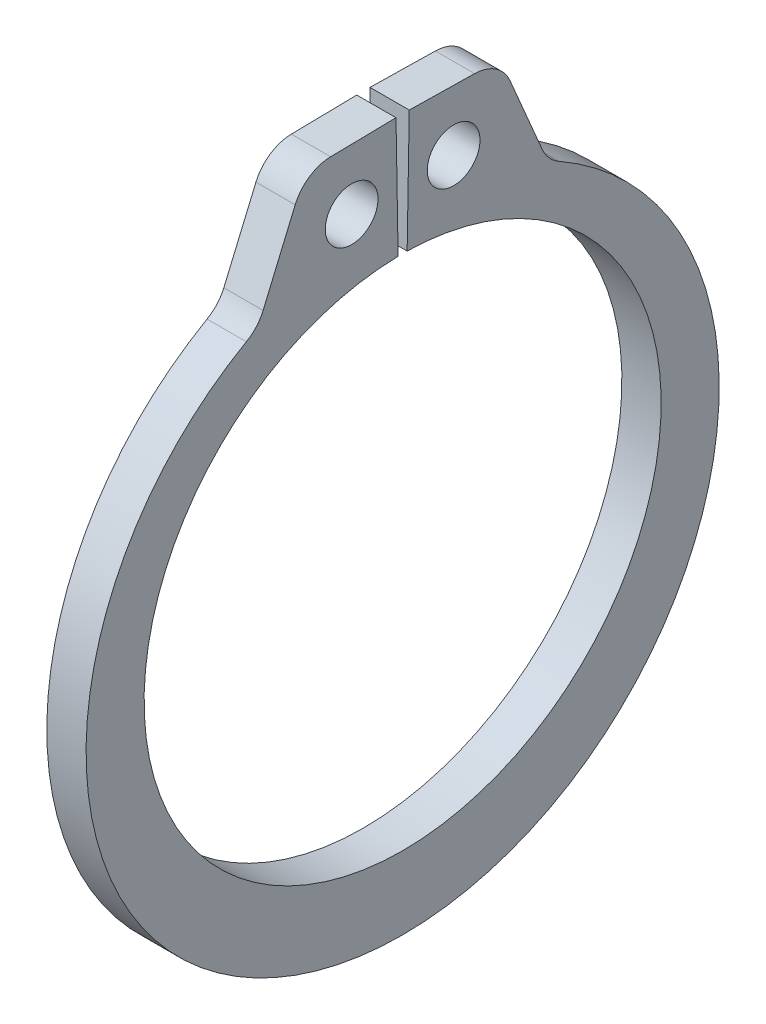
ISO-10303-21;
HEADER;
FILE_DESCRIPTION(('STEP AP214'),'2;1');
FILE_NAME('part.step','',(''),(''),'','','');
FILE_SCHEMA(('AUTOMOTIVE_DESIGN { 1 0 10303 214 1 1 1 1 }'));
ENDSEC;
DATA;
#1=APPLICATION_CONTEXT('core data for automotive mechanical design processes');
#2=APPLICATION_PROTOCOL_DEFINITION('international standard','automotive_design',2000,#1);
#3=PRODUCT_CONTEXT('',#1,'mechanical');
#4=PRODUCT('Part','Part','',(#3));
#5=PRODUCT_RELATED_PRODUCT_CATEGORY('part','',(#4));
#6=PRODUCT_DEFINITION_FORMATION('','',#4);
#7=PRODUCT_DEFINITION_CONTEXT('part definition',#1,'design');
#8=PRODUCT_DEFINITION('design','',#6,#7);
#9=PRODUCT_DEFINITION_SHAPE('','',#8);
#10=(LENGTH_UNIT() NAMED_UNIT(*) SI_UNIT(.MILLI.,.METRE.));
#11=(NAMED_UNIT(*) PLANE_ANGLE_UNIT() SI_UNIT($,.RADIAN.));
#12=(NAMED_UNIT(*) SI_UNIT($,.STERADIAN.) SOLID_ANGLE_UNIT());
#13=UNCERTAINTY_MEASURE_WITH_UNIT(LENGTH_MEASURE(1.E-05),#10,'distance_accuracy_value','');
#14=(GEOMETRIC_REPRESENTATION_CONTEXT(3) GLOBAL_UNCERTAINTY_ASSIGNED_CONTEXT((#13)) GLOBAL_UNIT_ASSIGNED_CONTEXT((#10,
#11,#12)) REPRESENTATION_CONTEXT('',''));
#15=CARTESIAN_POINT('',(0.,0.,0.));
#16=DIRECTION('',(0.,0.,1.));
#17=DIRECTION('',(1.,0.,0.));
#18=AXIS2_PLACEMENT_3D('',#15,#16,#17);
#19=CARTESIAN_POINT('',(0.444500000000014,0.,0.));
#20=DIRECTION('',(1.,0.,0.));
#21=DIRECTION('',(0.,0.,-1.));
#22=AXIS2_PLACEMENT_3D('',#19,#20,#21);
#23=PLANE('',#22);
#24=CARTESIAN_POINT('',(0.444500000000014,7.2072461090066,1.15465964864508));
#25=DIRECTION('',(1.,0.,0.));
#26=DIRECTION('',(0.,0.,-1.));
#27=AXIS2_PLACEMENT_3D('',#24,#25,#26);
#28=CIRCLE('',#27,0.5969);
#29=CARTESIAN_POINT('',(0.444500000000014,7.2072461090066,0.557759648645084));
#30=VERTEX_POINT('',#29);
#31=EDGE_CURVE('E225',#30,#30,#28,.T.);
#32=ORIENTED_EDGE('',*,*,#31,.F.);
#33=EDGE_LOOP('',(#32));
#34=FACE_BOUND('',#33,.T.);
#35=DIRECTION('',(0.,-0.0174524064372841,0.999847695156392));
#36=VECTOR('',#35,1.);
#37=CARTESIAN_POINT('',(0.444500000000014,8.59659049818514,0.150054045307102));
#38=LINE('',#37,#36);
#39=CARTESIAN_POINT('',(0.444500000000014,8.59659049818514,0.150054045307102));
#40=VERTEX_POINT('',#39);
#41=CARTESIAN_POINT('',(0.444500000000014,8.57074959100773,1.63047862600535));
#42=VERTEX_POINT('',#41);
#43=EDGE_CURVE('E137',#40,#42,#38,.T.);
#44=ORIENTED_EDGE('',*,*,#43,.T.);
#45=CARTESIAN_POINT('',(0.444500000000014,7.6818849900137,1.61496343668271));
#46=DIRECTION('',(1.,0.,0.));
#47=DIRECTION('',(0.,0.,-1.));
#48=AXIS2_PLACEMENT_3D('',#45,#46,#47);
#49=CIRCLE('',#48,0.889);
#50=CARTESIAN_POINT('',(0.444500000000016,8.02998759243227,2.4329766261787));
#51=VERTEX_POINT('',#50);
#52=EDGE_CURVE('E178',#42,#51,#49,.T.);
#53=ORIENTED_EDGE('',*,*,#52,.T.);
#54=DIRECTION('',(0.,-0.920149819455568,0.391566481910656));
#55=VECTOR('',#54,1.);
#56=CARTESIAN_POINT('',(0.444500000000016,8.56068391718108,2.20714069332184));
#57=LINE('',#56,#55);
#58=CARTESIAN_POINT('',(0.444500000000016,6.32221463110736,3.15971333386372));
#59=VERTEX_POINT('',#58);
#60=EDGE_CURVE('E217',#51,#59,#57,.T.);
#61=ORIENTED_EDGE('',*,*,#60,.T.);
#62=CARTESIAN_POINT('',(0.444500000000016,6.67031723352593,3.97772652335976));
#63=DIRECTION('',(1.,0.,0.));
#64=DIRECTION('',(0.,0.,-1.));
#65=AXIS2_PLACEMENT_3D('',#62,#63,#64);
#66=CIRCLE('',#65,0.889);
#67=CARTESIAN_POINT('',(0.444500000000014,5.89719335877509,3.53886381784674));
#68=VERTEX_POINT('',#67);
#69=EDGE_CURVE('E185',#59,#68,#66,.F.);
#70=ORIENTED_EDGE('',*,*,#69,.T.);
#71=CARTESIAN_POINT('',(0.444500000000014,-0.33705729114225,0.));
#72=DIRECTION('',(1.,0.,0.));
#73=DIRECTION('',(0.,0.,-1.));
#74=AXIS2_PLACEMENT_3D('',#71,#72,#73);
#75=CIRCLE('',#74,7.16864270885775);
#76=CARTESIAN_POINT('',(0.444500000000014,5.89719335877509,-3.53886381784668));
#77=VERTEX_POINT('',#76);
#78=EDGE_CURVE('E210',#68,#77,#75,.T.);
#79=ORIENTED_EDGE('',*,*,#78,.T.);
#80=CARTESIAN_POINT('',(0.444500000000016,6.67031723352594,-3.97772652335981));
#81=DIRECTION('',(1.,0.,0.));
#82=DIRECTION('',(0.,0.,-1.));
#83=AXIS2_PLACEMENT_3D('',#80,#81,#82);
#84=CIRCLE('',#83,0.889);
#85=CARTESIAN_POINT('',(0.444500000000016,6.32221463110736,-3.15971333386389));
#86=VERTEX_POINT('',#85);
#87=EDGE_CURVE('E11',#77,#86,#84,.F.);
#88=ORIENTED_EDGE('',*,*,#87,.T.);
#89=DIRECTION('',(0.,0.920149819455568,0.391566481910656));
#90=VECTOR('',#89,1.);
#91=CARTESIAN_POINT('',(0.444500000000016,8.56068391718108,-2.2071406933219));
#92=LINE('',#91,#90);
#93=CARTESIAN_POINT('',(0.444500000000016,8.02998759243227,-2.43297662617881));
#94=VERTEX_POINT('',#93);
#95=EDGE_CURVE('E209',#86,#94,#92,.T.);
#96=ORIENTED_EDGE('',*,*,#95,.T.);
#97=CARTESIAN_POINT('',(0.444500000000016,7.6818849900137,-1.61496343668277));
#98=DIRECTION('',(1.,0.,0.));
#99=DIRECTION('',(0.,0.,-1.));
#100=AXIS2_PLACEMENT_3D('',#97,#98,#99);
#101=CIRCLE('',#100,0.889);
#102=CARTESIAN_POINT('',(0.444500000000016,8.57074959100773,-1.63047862600557));
#103=VERTEX_POINT('',#102);
#104=EDGE_CURVE('E53',#94,#103,#101,.T.);
#105=ORIENTED_EDGE('',*,*,#104,.T.);
#106=DIRECTION('',(0.,0.0174524064372841,0.999847695156392));
#107=VECTOR('',#106,1.);
#108=CARTESIAN_POINT('',(0.444500000000014,8.59659049818515,-0.150054045307102));
#109=LINE('',#108,#107);
#110=CARTESIAN_POINT('',(0.444500000000014,8.59659049818515,-0.150054045307102));
#111=VERTEX_POINT('',#110);
#112=EDGE_CURVE('E214',#103,#111,#109,.T.);
#113=ORIENTED_EDGE('',*,*,#112,.T.);
#114=DIRECTION('',(0.,-0.999847695156393,0.0174524064372836));
#115=VECTOR('',#114,1.);
#116=CARTESIAN_POINT('',(0.444500000000014,5.85380830083213,-0.102178603968273));
#117=LINE('',#116,#115);
#118=CARTESIAN_POINT('',(0.444500000000014,5.85380830083213,-0.102178603968273));
#119=VERTEX_POINT('',#118);
#120=EDGE_CURVE('E143',#111,#119,#117,.T.);
#121=ORIENTED_EDGE('',*,*,#120,.T.);
#122=CARTESIAN_POINT('',(0.444500000000014,0.,0.));
#123=DIRECTION('',(-1.,0.,0.));
#124=DIRECTION('',(0.,0.,-1.));
#125=AXIS2_PLACEMENT_3D('',#122,#123,#124);
#126=CIRCLE('',#125,5.8547);
#127=CARTESIAN_POINT('',(0.444500000000014,5.85380830083213,0.102178603968384));
#128=VERTEX_POINT('',#127);
#129=EDGE_CURVE('E138',#119,#128,#126,.T.);
#130=ORIENTED_EDGE('',*,*,#129,.T.);
#131=DIRECTION('',(0.,0.999847695156392,0.0174524064372835));
#132=VECTOR('',#131,1.);
#133=CARTESIAN_POINT('',(0.444500000000014,5.85380830083213,0.102178603968384));
#134=LINE('',#133,#132);
#135=EDGE_CURVE('E129',#128,#40,#134,.T.);
#136=ORIENTED_EDGE('',*,*,#135,.T.);
#137=EDGE_LOOP('',(#44,#53,#61,#70,#79,#88,#96,#105,#113,#121,#130,#136));
#138=FACE_BOUND('',#137,.T.);
#139=CARTESIAN_POINT('',(0.444500000000013,7.20724610900661,-1.15465964864508));
#140=DIRECTION('',(1.,0.,0.));
#141=DIRECTION('',(0.,0.,-1.));
#142=AXIS2_PLACEMENT_3D('',#139,#140,#141);
#143=CIRCLE('',#142,0.5969);
#144=CARTESIAN_POINT('',(0.444500000000013,7.20724610900661,-1.75155964864509));
#145=VERTEX_POINT('',#144);
#146=EDGE_CURVE('E251',#145,#145,#143,.T.);
#147=ORIENTED_EDGE('',*,*,#146,.F.);
#148=EDGE_LOOP('',(#147));
#149=FACE_BOUND('',#148,.T.);
#150=ADVANCED_FACE('F38',(#34,#138,#149),#23,.T.);
#151=CARTESIAN_POINT('',(-0.444500000000014,0.,0.));
#152=DIRECTION('',(1.,0.,0.));
#153=DIRECTION('',(0.,0.,-1.));
#154=AXIS2_PLACEMENT_3D('',#151,#152,#153);
#155=PLANE('',#154);
#156=DIRECTION('',(0.,-0.920149819455568,0.391566481910656));
#157=VECTOR('',#156,1.);
#158=CARTESIAN_POINT('',(-0.444500000000013,8.56068391718108,2.20714069332184));
#159=LINE('',#158,#157);
#160=CARTESIAN_POINT('',(-0.444500000000013,8.02998759243227,2.4329766261787));
#161=VERTEX_POINT('',#160);
#162=CARTESIAN_POINT('',(-0.444500000000013,6.32221463110736,3.15971333386372));
#163=VERTEX_POINT('',#162);
#164=EDGE_CURVE('E204',#161,#163,#159,.T.);
#165=ORIENTED_EDGE('',*,*,#164,.F.);
#166=CARTESIAN_POINT('',(-0.444500000000014,7.6818849900137,1.61496343668271));
#167=DIRECTION('',(1.,0.,0.));
#168=DIRECTION('',(0.,0.,-1.));
#169=AXIS2_PLACEMENT_3D('',#166,#167,#168);
#170=CIRCLE('',#169,0.889);
#171=CARTESIAN_POINT('',(-0.444500000000014,8.57074959100773,1.63047862600535));
#172=VERTEX_POINT('',#171);
#173=EDGE_CURVE('E174',#161,#172,#170,.F.);
#174=ORIENTED_EDGE('',*,*,#173,.T.);
#175=DIRECTION('',(0.,-0.0174524064372841,0.999847695156392));
#176=VECTOR('',#175,1.);
#177=CARTESIAN_POINT('',(-0.444500000000014,8.59659049818514,0.150054045307102));
#178=LINE('',#177,#176);
#179=CARTESIAN_POINT('',(-0.444500000000014,8.59659049818514,0.150054045307102));
#180=VERTEX_POINT('',#179);
#181=EDGE_CURVE('E227',#180,#172,#178,.T.);
#182=ORIENTED_EDGE('',*,*,#181,.F.);
#183=DIRECTION('',(0.,0.999847695156392,0.0174524064372835));
#184=VECTOR('',#183,1.);
#185=CARTESIAN_POINT('',(-0.444500000000014,5.85380830083213,0.102178603968384));
#186=LINE('',#185,#184);
#187=CARTESIAN_POINT('',(-0.444500000000014,5.85380830083213,0.102178603968384));
#188=VERTEX_POINT('',#187);
#189=EDGE_CURVE('E224',#188,#180,#186,.T.);
#190=ORIENTED_EDGE('',*,*,#189,.F.);
#191=CARTESIAN_POINT('',(-0.444500000000014,0.,0.));
#192=DIRECTION('',(-1.,0.,0.));
#193=DIRECTION('',(0.,0.,-1.));
#194=AXIS2_PLACEMENT_3D('',#191,#192,#193);
#195=CIRCLE('',#194,5.8547);
#196=CARTESIAN_POINT('',(-0.444500000000014,5.85380830083213,-0.102178603968273));
#197=VERTEX_POINT('',#196);
#198=EDGE_CURVE('E151',#197,#188,#195,.T.);
#199=ORIENTED_EDGE('',*,*,#198,.F.);
#200=DIRECTION('',(0.,-0.999847695156393,0.0174524064372836));
#201=VECTOR('',#200,1.);
#202=CARTESIAN_POINT('',(-0.444500000000014,5.85380830083213,-0.102178603968273));
#203=LINE('',#202,#201);
#204=CARTESIAN_POINT('',(-0.444500000000014,8.59659049818515,-0.150054045307102));
#205=VERTEX_POINT('',#204);
#206=EDGE_CURVE('E147',#205,#197,#203,.T.);
#207=ORIENTED_EDGE('',*,*,#206,.F.);
#208=DIRECTION('',(0.,0.0174524064372841,0.999847695156392));
#209=VECTOR('',#208,1.);
#210=CARTESIAN_POINT('',(-0.444500000000014,8.59659049818515,-0.150054045307102));
#211=LINE('',#210,#209);
#212=CARTESIAN_POINT('',(-0.444500000000013,8.57074959100773,-1.63047862600557));
#213=VERTEX_POINT('',#212);
#214=EDGE_CURVE('E232',#213,#205,#211,.T.);
#215=ORIENTED_EDGE('',*,*,#214,.F.);
#216=CARTESIAN_POINT('',(-0.444500000000013,7.6818849900137,-1.61496343668277));
#217=DIRECTION('',(1.,0.,0.));
#218=DIRECTION('',(0.,0.,-1.));
#219=AXIS2_PLACEMENT_3D('',#216,#217,#218);
#220=CIRCLE('',#219,0.889);
#221=CARTESIAN_POINT('',(-0.444500000000013,8.02998759243227,-2.43297662617881));
#222=VERTEX_POINT('',#221);
#223=EDGE_CURVE('E172',#213,#222,#220,.F.);
#224=ORIENTED_EDGE('',*,*,#223,.T.);
#225=DIRECTION('',(0.,0.920149819455568,0.391566481910656));
#226=VECTOR('',#225,1.);
#227=CARTESIAN_POINT('',(-0.444500000000013,8.56068391718108,-2.2071406933219));
#228=LINE('',#227,#226);
#229=CARTESIAN_POINT('',(-0.444500000000013,6.32221463110736,-3.15971333386389));
#230=VERTEX_POINT('',#229);
#231=EDGE_CURVE('E195',#230,#222,#228,.T.);
#232=ORIENTED_EDGE('',*,*,#231,.F.);
#233=CARTESIAN_POINT('',(-0.444500000000013,6.67031723352594,-3.97772652335981));
#234=DIRECTION('',(1.,0.,0.));
#235=DIRECTION('',(0.,0.,-1.));
#236=AXIS2_PLACEMENT_3D('',#233,#234,#235);
#237=CIRCLE('',#236,0.889);
#238=CARTESIAN_POINT('',(-0.444500000000014,5.89719335877509,-3.53886381784668));
#239=VERTEX_POINT('',#238);
#240=EDGE_CURVE('E46',#230,#239,#237,.T.);
#241=ORIENTED_EDGE('',*,*,#240,.T.);
#242=CARTESIAN_POINT('',(-0.444500000000014,-0.337057291142249,0.));
#243=DIRECTION('',(1.,0.,0.));
#244=DIRECTION('',(0.,0.,-1.));
#245=AXIS2_PLACEMENT_3D('',#242,#243,#244);
#246=CIRCLE('',#245,7.16864270885775);
#247=CARTESIAN_POINT('',(-0.444500000000014,5.89719335877509,3.53886381784674));
#248=VERTEX_POINT('',#247);
#249=EDGE_CURVE('E193',#248,#239,#246,.T.);
#250=ORIENTED_EDGE('',*,*,#249,.F.);
#251=CARTESIAN_POINT('',(-0.444500000000013,6.67031723352593,3.97772652335976));
#252=DIRECTION('',(1.,0.,0.));
#253=DIRECTION('',(0.,0.,-1.));
#254=AXIS2_PLACEMENT_3D('',#251,#252,#253);
#255=CIRCLE('',#254,0.889);
#256=EDGE_CURVE('E183',#248,#163,#255,.T.);
#257=ORIENTED_EDGE('',*,*,#256,.T.);
#258=EDGE_LOOP('',(#165,#174,#182,#190,#199,#207,#215,#224,#232,#241,#250,#257));
#259=FACE_BOUND('',#258,.T.);
#260=CARTESIAN_POINT('',(-0.444500000000014,7.2072461090066,1.15465964864508));
#261=DIRECTION('',(1.,0.,0.));
#262=DIRECTION('',(0.,0.,-1.));
#263=AXIS2_PLACEMENT_3D('',#260,#261,#262);
#264=CIRCLE('',#263,0.5969);
#265=CARTESIAN_POINT('',(-0.444500000000014,7.2072461090066,0.557759648645084));
#266=VERTEX_POINT('',#265);
#267=EDGE_CURVE('E248',#266,#266,#264,.T.);
#268=ORIENTED_EDGE('',*,*,#267,.T.);
#269=EDGE_LOOP('',(#268));
#270=FACE_BOUND('',#269,.T.);
#271=CARTESIAN_POINT('',(-0.444500000000016,7.20724610900661,-1.15465964864508));
#272=DIRECTION('',(1.,0.,0.));
#273=DIRECTION('',(0.,0.,-1.));
#274=AXIS2_PLACEMENT_3D('',#271,#272,#273);
#275=CIRCLE('',#274,0.5969);
#276=CARTESIAN_POINT('',(-0.444500000000016,7.20724610900661,-1.75155964864509));
#277=VERTEX_POINT('',#276);
#278=EDGE_CURVE('E254',#277,#277,#275,.T.);
#279=ORIENTED_EDGE('',*,*,#278,.T.);
#280=EDGE_LOOP('',(#279));
#281=FACE_BOUND('',#280,.T.);
#282=ADVANCED_FACE('F191',(#259,#270,#281),#155,.F.);
#283=CARTESIAN_POINT('',(0.444500000000014,0.,0.));
#284=DIRECTION('',(-1.,0.,0.));
#285=DIRECTION('',(0.,0.,1.));
#286=AXIS2_PLACEMENT_3D('',#283,#284,#285);
#287=CYLINDRICAL_SURFACE('',#286,5.8547);
#288=ORIENTED_EDGE('',*,*,#198,.T.);
#289=DIRECTION('',(-1.,0.,0.));
#290=VECTOR('',#289,1.);
#291=CARTESIAN_POINT('',(0.444500000000014,5.85380830083213,0.102178603968384));
#292=LINE('',#291,#290);
#293=EDGE_CURVE('E133',#128,#188,#292,.T.);
#294=ORIENTED_EDGE('',*,*,#293,.F.);
#295=ORIENTED_EDGE('',*,*,#129,.F.);
#296=DIRECTION('',(-1.,0.,0.));
#297=VECTOR('',#296,1.);
#298=CARTESIAN_POINT('',(0.444500000000014,5.85380830083213,-0.102178603968273));
#299=LINE('',#298,#297);
#300=EDGE_CURVE('E222',#119,#197,#299,.T.);
#301=ORIENTED_EDGE('',*,*,#300,.T.);
#302=EDGE_LOOP('',(#288,#294,#295,#301));
#303=FACE_BOUND('',#302,.T.);
#304=ADVANCED_FACE('F149',(#303),#287,.F.);
#305=CARTESIAN_POINT('',(0.444500000000014,5.85380830083213,0.102178603968384));
#306=DIRECTION('',(0.,-0.0174524064372836,0.999847695156392));
#307=DIRECTION('',(0.,-0.999847695156392,-0.0174524064372835));
#308=AXIS2_PLACEMENT_3D('',#305,#306,#307);
#309=PLANE('',#308);
#310=ORIENTED_EDGE('',*,*,#189,.T.);
#311=DIRECTION('',(-1.,0.,0.));
#312=VECTOR('',#311,1.);
#313=CARTESIAN_POINT('',(0.444500000000014,8.59659049818514,0.150054045307102));
#314=LINE('',#313,#312);
#315=EDGE_CURVE('E136',#40,#180,#314,.T.);
#316=ORIENTED_EDGE('',*,*,#315,.F.);
#317=ORIENTED_EDGE('',*,*,#135,.F.);
#318=ORIENTED_EDGE('',*,*,#293,.T.);
#319=EDGE_LOOP('',(#310,#316,#317,#318));
#320=FACE_BOUND('',#319,.T.);
#321=ADVANCED_FACE('F131',(#320),#309,.F.);
#322=CARTESIAN_POINT('',(0.444500000000014,8.59659049818514,0.150054045307102));
#323=DIRECTION('',(0.,-0.999847695156392,-0.0174524064372841));
#324=DIRECTION('',(0.,0.0174524064372841,-0.999847695156393));
#325=AXIS2_PLACEMENT_3D('',#322,#323,#324);
#326=PLANE('',#325);
#327=ORIENTED_EDGE('',*,*,#181,.T.);
#328=DIRECTION('',(-1.,0.,0.));
#329=VECTOR('',#328,1.);
#330=CARTESIAN_POINT('',(0.444500000000014,8.57074959100773,1.63047862600535));
#331=LINE('',#330,#329);
#332=EDGE_CURVE('E61',#172,#42,#331,.F.);
#333=ORIENTED_EDGE('',*,*,#332,.T.);
#334=ORIENTED_EDGE('',*,*,#43,.F.);
#335=ORIENTED_EDGE('',*,*,#315,.T.);
#336=EDGE_LOOP('',(#327,#333,#334,#335));
#337=FACE_BOUND('',#336,.T.);
#338=ADVANCED_FACE('F243',(#337),#326,.F.);
#339=CARTESIAN_POINT('',(0.444500000000016,8.56068391718108,2.20714069332184));
#340=DIRECTION('',(0.,-0.391566481910656,-0.920149819455568));
#341=DIRECTION('',(0.,0.920149819455568,-0.391566481910656));
#342=AXIS2_PLACEMENT_3D('',#339,#340,#341);
#343=PLANE('',#342);
#344=ORIENTED_EDGE('',*,*,#164,.T.);
#345=DIRECTION('',(1.,0.,0.));
#346=VECTOR('',#345,1.);
#347=CARTESIAN_POINT('',(0.444500000000016,6.32221463110736,3.15971333386372));
#348=LINE('',#347,#346);
#349=EDGE_CURVE('E165',#163,#59,#348,.T.);
#350=ORIENTED_EDGE('',*,*,#349,.T.);
#351=ORIENTED_EDGE('',*,*,#60,.F.);
#352=DIRECTION('',(-1.,0.,0.));
#353=VECTOR('',#352,1.);
#354=CARTESIAN_POINT('',(0.444500000000016,8.02998759243227,2.4329766261787));
#355=LINE('',#354,#353);
#356=EDGE_CURVE('E162',#51,#161,#355,.T.);
#357=ORIENTED_EDGE('',*,*,#356,.T.);
#358=EDGE_LOOP('',(#344,#350,#351,#357));
#359=FACE_BOUND('',#358,.T.);
#360=ADVANCED_FACE('F283',(#359),#343,.F.);
#361=CARTESIAN_POINT('',(0.444500000000014,-0.33705729114225,0.));
#362=DIRECTION('',(-1.,0.,0.));
#363=DIRECTION('',(0.,0.,1.));
#364=AXIS2_PLACEMENT_3D('',#361,#362,#363);
#365=CYLINDRICAL_SURFACE('',#364,7.16864270885775);
#366=ORIENTED_EDGE('',*,*,#78,.F.);
#367=DIRECTION('',(-1.,0.,0.));
#368=VECTOR('',#367,1.);
#369=CARTESIAN_POINT('',(0.444500000000014,5.89719335877509,3.53886381784674));
#370=LINE('',#369,#368);
#371=EDGE_CURVE('E154',#68,#248,#370,.T.);
#372=ORIENTED_EDGE('',*,*,#371,.T.);
#373=ORIENTED_EDGE('',*,*,#249,.T.);
#374=DIRECTION('',(-1.,0.,0.));
#375=VECTOR('',#374,1.);
#376=CARTESIAN_POINT('',(0.444500000000014,5.89719335877509,-3.53886381784668));
#377=LINE('',#376,#375);
#378=EDGE_CURVE('E152',#239,#77,#377,.F.);
#379=ORIENTED_EDGE('',*,*,#378,.T.);
#380=EDGE_LOOP('',(#366,#372,#373,#379));
#381=FACE_BOUND('',#380,.T.);
#382=ADVANCED_FACE('F201',(#381),#365,.T.);
#383=CARTESIAN_POINT('',(0.444500000000016,8.56068391718108,-2.2071406933219));
#384=DIRECTION('',(0.,-0.391566481910656,0.920149819455568));
#385=DIRECTION('',(0.,-0.920149819455568,-0.391566481910656));
#386=AXIS2_PLACEMENT_3D('',#383,#384,#385);
#387=PLANE('',#386);
#388=ORIENTED_EDGE('',*,*,#95,.F.);
#389=DIRECTION('',(1.,0.,0.));
#390=VECTOR('',#389,1.);
#391=CARTESIAN_POINT('',(-0.444500000000013,6.32221463110736,-3.15971333386389));
#392=LINE('',#391,#390);
#393=EDGE_CURVE('E169',#86,#230,#392,.F.);
#394=ORIENTED_EDGE('',*,*,#393,.T.);
#395=ORIENTED_EDGE('',*,*,#231,.T.);
#396=DIRECTION('',(-1.,0.,0.));
#397=VECTOR('',#396,1.);
#398=CARTESIAN_POINT('',(0.444500000000016,8.02998759243227,-2.43297662617881));
#399=LINE('',#398,#397);
#400=EDGE_CURVE('E167',#222,#94,#399,.F.);
#401=ORIENTED_EDGE('',*,*,#400,.T.);
#402=EDGE_LOOP('',(#388,#394,#395,#401));
#403=FACE_BOUND('',#402,.T.);
#404=ADVANCED_FACE('F212',(#403),#387,.F.);
#405=CARTESIAN_POINT('',(0.444500000000014,8.59659049818515,-0.150054045307102));
#406=DIRECTION('',(0.,-0.999847695156392,0.0174524064372841));
#407=DIRECTION('',(0.,-0.0174524064372841,-0.999847695156393));
#408=AXIS2_PLACEMENT_3D('',#405,#406,#407);
#409=PLANE('',#408);
#410=ORIENTED_EDGE('',*,*,#112,.F.);
#411=DIRECTION('',(-1.,0.,0.));
#412=VECTOR('',#411,1.);
#413=CARTESIAN_POINT('',(0.444500000000016,8.57074959100773,-1.63047862600557));
#414=LINE('',#413,#412);
#415=EDGE_CURVE('E180',#103,#213,#414,.T.);
#416=ORIENTED_EDGE('',*,*,#415,.T.);
#417=ORIENTED_EDGE('',*,*,#214,.T.);
#418=DIRECTION('',(-1.,0.,0.));
#419=VECTOR('',#418,1.);
#420=CARTESIAN_POINT('',(0.444500000000014,8.59659049818515,-0.150054045307102));
#421=LINE('',#420,#419);
#422=EDGE_CURVE('E156',#111,#205,#421,.T.);
#423=ORIENTED_EDGE('',*,*,#422,.F.);
#424=EDGE_LOOP('',(#410,#416,#417,#423));
#425=FACE_BOUND('',#424,.T.);
#426=ADVANCED_FACE('F276',(#425),#409,.F.);
#427=CARTESIAN_POINT('',(0.444500000000014,5.85380830083213,-0.102178603968273));
#428=DIRECTION('',(0.,-0.0174524064372835,-0.999847695156393));
#429=DIRECTION('',(0.,0.999847695156393,-0.0174524064372836));
#430=AXIS2_PLACEMENT_3D('',#427,#428,#429);
#431=PLANE('',#430);
#432=ORIENTED_EDGE('',*,*,#206,.T.);
#433=ORIENTED_EDGE('',*,*,#300,.F.);
#434=ORIENTED_EDGE('',*,*,#120,.F.);
#435=ORIENTED_EDGE('',*,*,#422,.T.);
#436=EDGE_LOOP('',(#432,#433,#434,#435));
#437=FACE_BOUND('',#436,.T.);
#438=ADVANCED_FACE('F239',(#437),#431,.F.);
#439=CARTESIAN_POINT('',(0.444500000000014,7.2072461090066,1.15465964864508));
#440=DIRECTION('',(-1.,0.,0.));
#441=DIRECTION('',(0.,0.,1.));
#442=AXIS2_PLACEMENT_3D('',#439,#440,#441);
#443=CYLINDRICAL_SURFACE('',#442,0.5969);
#444=ORIENTED_EDGE('',*,*,#31,.T.);
#445=EDGE_LOOP('',(#444));
#446=FACE_BOUND('',#445,.T.);
#447=ORIENTED_EDGE('',*,*,#267,.F.);
#448=EDGE_LOOP('',(#447));
#449=FACE_BOUND('',#448,.T.);
#450=ADVANCED_FACE('F271',(#446,#449),#443,.F.);
#451=CARTESIAN_POINT('',(0.444500000000013,7.20724610900661,-1.15465964864508));
#452=DIRECTION('',(-1.,0.,0.));
#453=DIRECTION('',(0.,0.,1.));
#454=AXIS2_PLACEMENT_3D('',#451,#452,#453);
#455=CYLINDRICAL_SURFACE('',#454,0.5969);
#456=ORIENTED_EDGE('',*,*,#146,.T.);
#457=EDGE_LOOP('',(#456));
#458=FACE_BOUND('',#457,.T.);
#459=ORIENTED_EDGE('',*,*,#278,.F.);
#460=EDGE_LOOP('',(#459));
#461=FACE_BOUND('',#460,.T.);
#462=ADVANCED_FACE('F260',(#458,#461),#455,.F.);
#463=CARTESIAN_POINT('',(0.444500000000016,6.67031723352593,3.97772652335976));
#464=DIRECTION('',(-1.,0.,0.));
#465=DIRECTION('',(0.,0.,1.));
#466=AXIS2_PLACEMENT_3D('',#463,#464,#465);
#467=CYLINDRICAL_SURFACE('',#466,0.889);
#468=ORIENTED_EDGE('',*,*,#69,.F.);
#469=ORIENTED_EDGE('',*,*,#349,.F.);
#470=ORIENTED_EDGE('',*,*,#256,.F.);
#471=ORIENTED_EDGE('',*,*,#371,.F.);
#472=EDGE_LOOP('',(#468,#469,#470,#471));
#473=FACE_BOUND('',#472,.T.);
#474=ADVANCED_FACE('F293',(#473),#467,.F.);
#475=CARTESIAN_POINT('',(0.444500000000016,6.67031723352594,-3.97772652335981));
#476=DIRECTION('',(-1.,0.,0.));
#477=DIRECTION('',(0.,0.,1.));
#478=AXIS2_PLACEMENT_3D('',#475,#476,#477);
#479=CYLINDRICAL_SURFACE('',#478,0.889);
#480=ORIENTED_EDGE('',*,*,#87,.F.);
#481=ORIENTED_EDGE('',*,*,#378,.F.);
#482=ORIENTED_EDGE('',*,*,#240,.F.);
#483=ORIENTED_EDGE('',*,*,#393,.F.);
#484=EDGE_LOOP('',(#480,#481,#482,#483));
#485=FACE_BOUND('',#484,.T.);
#486=ADVANCED_FACE('F207',(#485),#479,.F.);
#487=CARTESIAN_POINT('',(0.444500000000014,7.6818849900137,1.61496343668271));
#488=DIRECTION('',(-1.,0.,0.));
#489=DIRECTION('',(0.,0.,1.));
#490=AXIS2_PLACEMENT_3D('',#487,#488,#489);
#491=CYLINDRICAL_SURFACE('',#490,0.889);
#492=ORIENTED_EDGE('',*,*,#52,.F.);
#493=ORIENTED_EDGE('',*,*,#332,.F.);
#494=ORIENTED_EDGE('',*,*,#173,.F.);
#495=ORIENTED_EDGE('',*,*,#356,.F.);
#496=EDGE_LOOP('',(#492,#493,#494,#495));
#497=FACE_BOUND('',#496,.T.);
#498=ADVANCED_FACE('F298',(#497),#491,.T.);
#499=CARTESIAN_POINT('',(0.444500000000016,7.6818849900137,-1.61496343668277));
#500=DIRECTION('',(-1.,0.,0.));
#501=DIRECTION('',(0.,0.,1.));
#502=AXIS2_PLACEMENT_3D('',#499,#500,#501);
#503=CYLINDRICAL_SURFACE('',#502,0.889);
#504=ORIENTED_EDGE('',*,*,#104,.F.);
#505=ORIENTED_EDGE('',*,*,#400,.F.);
#506=ORIENTED_EDGE('',*,*,#223,.F.);
#507=ORIENTED_EDGE('',*,*,#415,.F.);
#508=EDGE_LOOP('',(#504,#505,#506,#507));
#509=FACE_BOUND('',#508,.T.);
#510=ADVANCED_FACE('F40',(#509),#503,.T.);
#511=CLOSED_SHELL('',(#150,#282,#304,#321,#338,#360,#382,#404,#426,#438,#450,#462,#474,#486,
#498,#510));
#512=MANIFOLD_SOLID_BREP('B2',#511);
#513=ADVANCED_BREP_SHAPE_REPRESENTATION('',(#18,#512),#14);
#514=SHAPE_DEFINITION_REPRESENTATION(#9,#513);
ENDSEC;
END-ISO-10303-21;
